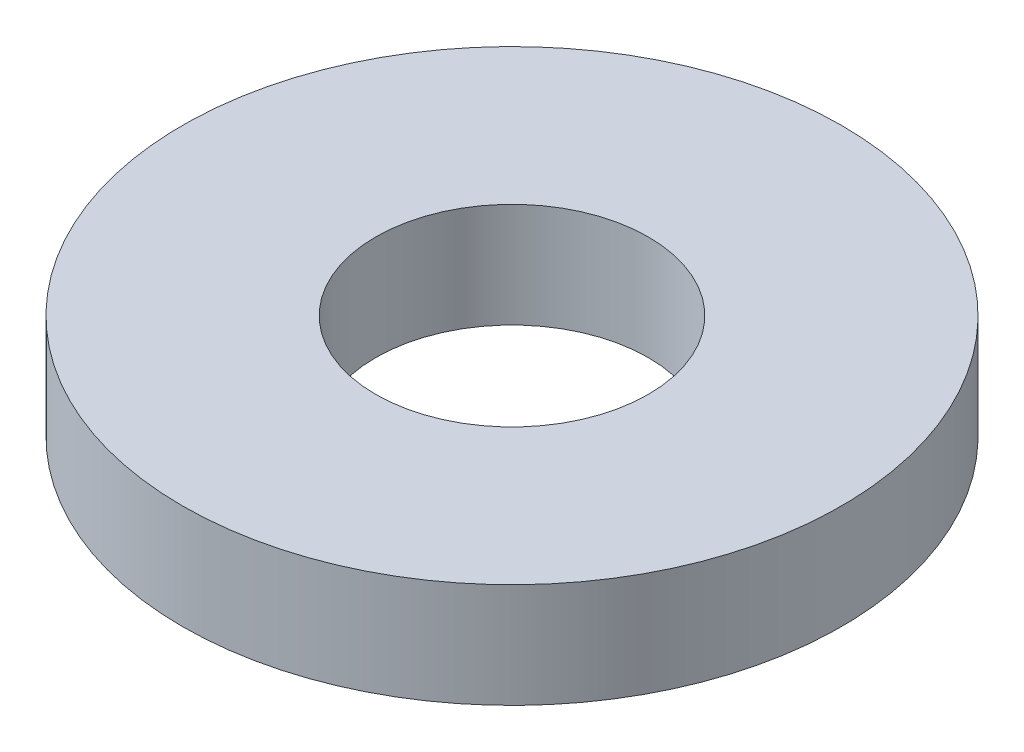
ISO-10303-21;
HEADER;
FILE_DESCRIPTION(('STEP AP214'),'2;1');
FILE_NAME('part.step','',(''),(''),'','','');
FILE_SCHEMA(('AUTOMOTIVE_DESIGN { 1 0 10303 214 1 1 1 1 }'));
ENDSEC;
DATA;
#1=APPLICATION_CONTEXT('core data for automotive mechanical design processes');
#2=APPLICATION_PROTOCOL_DEFINITION('international standard','automotive_design',2000,#1);
#3=PRODUCT_CONTEXT('',#1,'mechanical');
#4=PRODUCT('Part','Part','',(#3));
#5=PRODUCT_RELATED_PRODUCT_CATEGORY('part','',(#4));
#6=PRODUCT_DEFINITION_FORMATION('','',#4);
#7=PRODUCT_DEFINITION_CONTEXT('part definition',#1,'design');
#8=PRODUCT_DEFINITION('design','',#6,#7);
#9=PRODUCT_DEFINITION_SHAPE('','',#8);
#10=(LENGTH_UNIT() NAMED_UNIT(*) SI_UNIT(.MILLI.,.METRE.));
#11=(NAMED_UNIT(*) PLANE_ANGLE_UNIT() SI_UNIT($,.RADIAN.));
#12=(NAMED_UNIT(*) SI_UNIT($,.STERADIAN.) SOLID_ANGLE_UNIT());
#13=UNCERTAINTY_MEASURE_WITH_UNIT(LENGTH_MEASURE(1.E-05),#10,'distance_accuracy_value','');
#14=(GEOMETRIC_REPRESENTATION_CONTEXT(3) GLOBAL_UNCERTAINTY_ASSIGNED_CONTEXT((#13)) GLOBAL_UNIT_ASSIGNED_CONTEXT((#10,
#11,#12)) REPRESENTATION_CONTEXT('',''));
#15=CARTESIAN_POINT('',(0.,0.,0.));
#16=DIRECTION('',(0.,0.,1.));
#17=DIRECTION('',(1.,0.,0.));
#18=AXIS2_PLACEMENT_3D('',#15,#16,#17);
#19=CARTESIAN_POINT('',(0.,23.,0.));
#20=DIRECTION('',(0.,-1.,0.));
#21=DIRECTION('',(0.,0.,-1.));
#22=AXIS2_PLACEMENT_3D('',#19,#20,#21);
#23=CYLINDRICAL_SURFACE('',#22,72.5);
#24=CARTESIAN_POINT('',(0.,23.,0.));
#25=DIRECTION('',(0.,1.,0.));
#26=DIRECTION('',(0.,0.,1.));
#27=AXIS2_PLACEMENT_3D('',#24,#25,#26);
#28=CIRCLE('',#27,72.5);
#29=CARTESIAN_POINT('',(0.,23.,72.5));
#30=VERTEX_POINT('',#29);
#31=EDGE_CURVE('E10',#30,#30,#28,.T.);
#32=ORIENTED_EDGE('',*,*,#31,.F.);
#33=EDGE_LOOP('',(#32));
#34=FACE_BOUND('',#33,.T.);
#35=CARTESIAN_POINT('',(0.,0.,0.));
#36=DIRECTION('',(0.,1.,0.));
#37=DIRECTION('',(0.,0.,1.));
#38=AXIS2_PLACEMENT_3D('',#35,#36,#37);
#39=CIRCLE('',#38,72.5);
#40=CARTESIAN_POINT('',(0.,0.,72.5));
#41=VERTEX_POINT('',#40);
#42=EDGE_CURVE('E37',#41,#41,#39,.T.);
#43=ORIENTED_EDGE('',*,*,#42,.T.);
#44=EDGE_LOOP('',(#43));
#45=FACE_BOUND('',#44,.T.);
#46=ADVANCED_FACE('F40',(#34,#45),#23,.T.);
#47=CARTESIAN_POINT('',(0.,23.,0.));
#48=DIRECTION('',(0.,1.,0.));
#49=DIRECTION('',(0.,0.,1.));
#50=AXIS2_PLACEMENT_3D('',#47,#48,#49);
#51=PLANE('',#50);
#52=CARTESIAN_POINT('',(0.,23.,0.));
#53=DIRECTION('',(0.,1.,0.));
#54=DIRECTION('',(0.,0.,1.));
#55=AXIS2_PLACEMENT_3D('',#52,#53,#54);
#56=CIRCLE('',#55,30.);
#57=CARTESIAN_POINT('',(0.,23.,30.));
#58=VERTEX_POINT('',#57);
#59=EDGE_CURVE('E50',#58,#58,#56,.T.);
#60=ORIENTED_EDGE('',*,*,#59,.F.);
#61=EDGE_LOOP('',(#60));
#62=FACE_BOUND('',#61,.T.);
#63=ORIENTED_EDGE('',*,*,#31,.T.);
#64=EDGE_LOOP('',(#63));
#65=FACE_BOUND('',#64,.T.);
#66=ADVANCED_FACE('F59',(#62,#65),#51,.T.);
#67=CARTESIAN_POINT('',(0.,0.,0.));
#68=DIRECTION('',(0.,1.,0.));
#69=DIRECTION('',(0.,0.,1.));
#70=AXIS2_PLACEMENT_3D('',#67,#68,#69);
#71=PLANE('',#70);
#72=CARTESIAN_POINT('',(0.,0.,0.));
#73=DIRECTION('',(0.,1.,0.));
#74=DIRECTION('',(0.,0.,1.));
#75=AXIS2_PLACEMENT_3D('',#72,#73,#74);
#76=CIRCLE('',#75,30.);
#77=CARTESIAN_POINT('',(0.,0.,30.));
#78=VERTEX_POINT('',#77);
#79=EDGE_CURVE('E47',#78,#78,#76,.T.);
#80=ORIENTED_EDGE('',*,*,#79,.T.);
#81=EDGE_LOOP('',(#80));
#82=FACE_BOUND('',#81,.T.);
#83=ORIENTED_EDGE('',*,*,#42,.F.);
#84=EDGE_LOOP('',(#83));
#85=FACE_BOUND('',#84,.T.);
#86=ADVANCED_FACE('F58',(#82,#85),#71,.F.);
#87=CARTESIAN_POINT('',(0.,23.,0.));
#88=DIRECTION('',(0.,-1.,0.));
#89=DIRECTION('',(0.,0.,-1.));
#90=AXIS2_PLACEMENT_3D('',#87,#88,#89);
#91=CYLINDRICAL_SURFACE('',#90,30.);
#92=ORIENTED_EDGE('',*,*,#59,.T.);
#93=EDGE_LOOP('',(#92));
#94=FACE_BOUND('',#93,.T.);
#95=ORIENTED_EDGE('',*,*,#79,.F.);
#96=EDGE_LOOP('',(#95));
#97=FACE_BOUND('',#96,.T.);
#98=ADVANCED_FACE('F54',(#94,#97),#91,.F.);
#99=CLOSED_SHELL('',(#46,#66,#86,#98));
#100=MANIFOLD_SOLID_BREP('B2',#99);
#101=ADVANCED_BREP_SHAPE_REPRESENTATION('',(#18,#100),#14);
#102=SHAPE_DEFINITION_REPRESENTATION(#9,#101);
ENDSEC;
END-ISO-10303-21;
